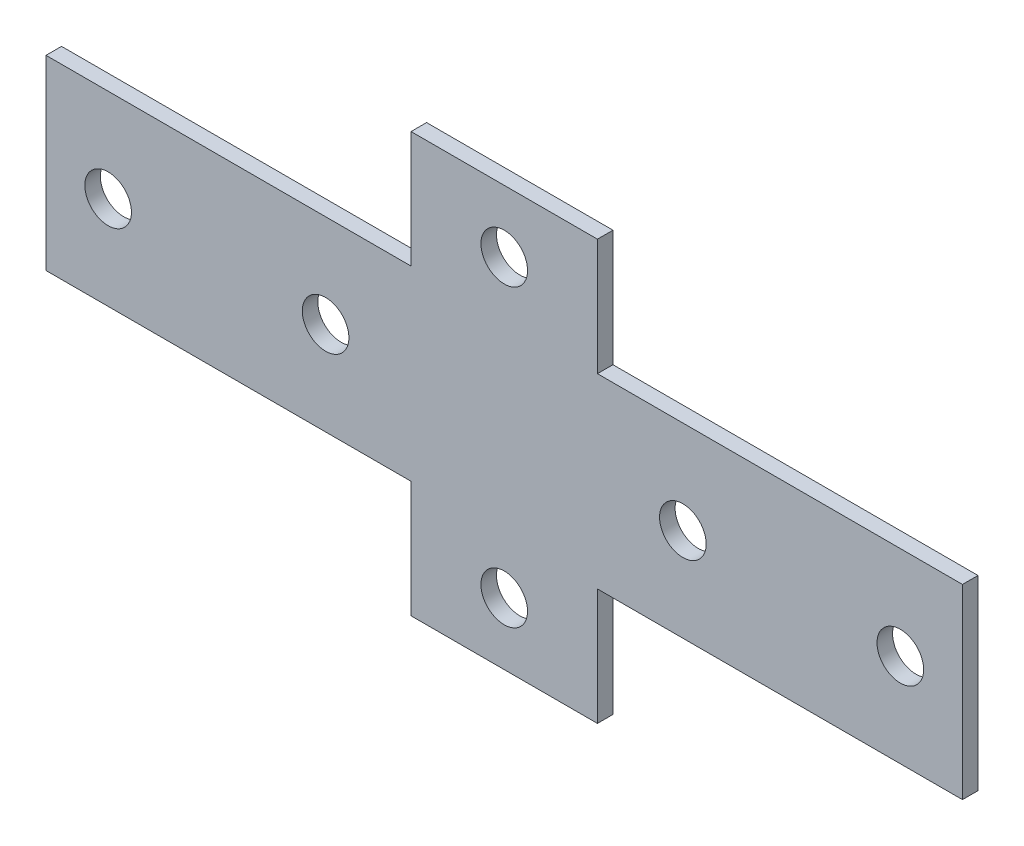
ISO-10303-21;
HEADER;
FILE_DESCRIPTION(('STEP AP214'),'2;1');
FILE_NAME('part.step','',(''),(''),'','','');
FILE_SCHEMA(('AUTOMOTIVE_DESIGN { 1 0 10303 214 1 1 1 1 }'));
ENDSEC;
DATA;
#1=APPLICATION_CONTEXT('core data for automotive mechanical design processes');
#2=APPLICATION_PROTOCOL_DEFINITION('international standard','automotive_design',2000,#1);
#3=PRODUCT_CONTEXT('',#1,'mechanical');
#4=PRODUCT('Part','Part','',(#3));
#5=PRODUCT_RELATED_PRODUCT_CATEGORY('part','',(#4));
#6=PRODUCT_DEFINITION_FORMATION('','',#4);
#7=PRODUCT_DEFINITION_CONTEXT('part definition',#1,'design');
#8=PRODUCT_DEFINITION('design','',#6,#7);
#9=PRODUCT_DEFINITION_SHAPE('','',#8);
#10=(LENGTH_UNIT() NAMED_UNIT(*) SI_UNIT(.MILLI.,.METRE.));
#11=(NAMED_UNIT(*) PLANE_ANGLE_UNIT() SI_UNIT($,.RADIAN.));
#12=(NAMED_UNIT(*) SI_UNIT($,.STERADIAN.) SOLID_ANGLE_UNIT());
#13=UNCERTAINTY_MEASURE_WITH_UNIT(LENGTH_MEASURE(1.E-05),#10,'distance_accuracy_value','');
#14=(GEOMETRIC_REPRESENTATION_CONTEXT(3) GLOBAL_UNCERTAINTY_ASSIGNED_CONTEXT((#13)) GLOBAL_UNIT_ASSIGNED_CONTEXT((#10,
#11,#12)) REPRESENTATION_CONTEXT('',''));
#15=CARTESIAN_POINT('',(0.,0.,0.));
#16=DIRECTION('',(0.,0.,1.));
#17=DIRECTION('',(1.,0.,0.));
#18=AXIS2_PLACEMENT_3D('',#15,#16,#17);
#19=CARTESIAN_POINT('',(0.,0.,3.));
#20=DIRECTION('',(0.,0.,1.));
#21=DIRECTION('',(1.,0.,0.));
#22=AXIS2_PLACEMENT_3D('',#19,#20,#21);
#23=PLANE('',#22);
#24=CARTESIAN_POINT('',(34.4999999999999,0.,3.));
#25=DIRECTION('',(0.,0.,1.));
#26=DIRECTION('',(-1.,0.,0.));
#27=AXIS2_PLACEMENT_3D('',#24,#25,#26);
#28=CIRCLE('',#27,4.5);
#29=CARTESIAN_POINT('',(29.9999999999999,0.,3.));
#30=VERTEX_POINT('',#29);
#31=EDGE_CURVE('E300',#30,#30,#28,.T.);
#32=ORIENTED_EDGE('',*,*,#31,.F.);
#33=EDGE_LOOP('',(#32));
#34=FACE_BOUND('',#33,.T.);
#35=CARTESIAN_POINT('',(-76.4999999999999,0.,3.));
#36=DIRECTION('',(0.,0.,1.));
#37=DIRECTION('',(1.,0.,0.));
#38=AXIS2_PLACEMENT_3D('',#35,#36,#37);
#39=CIRCLE('',#38,4.5);
#40=CARTESIAN_POINT('',(-71.9999999999999,0.,3.));
#41=VERTEX_POINT('',#40);
#42=EDGE_CURVE('E312',#41,#41,#39,.T.);
#43=ORIENTED_EDGE('',*,*,#42,.F.);
#44=EDGE_LOOP('',(#43));
#45=FACE_BOUND('',#44,.T.);
#46=CARTESIAN_POINT('',(0.,-28.5,3.));
#47=DIRECTION('',(0.,0.,1.));
#48=DIRECTION('',(1.,0.,0.));
#49=AXIS2_PLACEMENT_3D('',#46,#47,#48);
#50=CIRCLE('',#49,4.5);
#51=CARTESIAN_POINT('',(4.5,-28.5,3.));
#52=VERTEX_POINT('',#51);
#53=EDGE_CURVE('E159',#52,#52,#50,.T.);
#54=ORIENTED_EDGE('',*,*,#53,.F.);
#55=EDGE_LOOP('',(#54));
#56=FACE_BOUND('',#55,.T.);
#57=DIRECTION('',(0.,1.,0.));
#58=VECTOR('',#57,1.);
#59=CARTESIAN_POINT('',(88.5000000000001,18.,3.));
#60=LINE('',#59,#58);
#61=CARTESIAN_POINT('',(88.5000000000001,-18.,3.));
#62=VERTEX_POINT('',#61);
#63=CARTESIAN_POINT('',(88.5000000000001,18.,3.));
#64=VERTEX_POINT('',#63);
#65=EDGE_CURVE('E178',#62,#64,#60,.T.);
#66=ORIENTED_EDGE('',*,*,#65,.T.);
#67=DIRECTION('',(-1.,0.,0.));
#68=VECTOR('',#67,1.);
#69=CARTESIAN_POINT('',(18.,18.,3.));
#70=LINE('',#69,#68);
#71=CARTESIAN_POINT('',(18.,18.,3.));
#72=VERTEX_POINT('',#71);
#73=EDGE_CURVE('E106',#64,#72,#70,.T.);
#74=ORIENTED_EDGE('',*,*,#73,.T.);
#75=DIRECTION('',(0.,1.,0.));
#76=VECTOR('',#75,1.);
#77=CARTESIAN_POINT('',(18.,18.,3.));
#78=LINE('',#77,#76);
#79=CARTESIAN_POINT('',(18.,40.5,3.));
#80=VERTEX_POINT('',#79);
#81=EDGE_CURVE('E205',#72,#80,#78,.T.);
#82=ORIENTED_EDGE('',*,*,#81,.T.);
#83=DIRECTION('',(-1.,0.,0.));
#84=VECTOR('',#83,1.);
#85=CARTESIAN_POINT('',(-18.,40.5,3.));
#86=LINE('',#85,#84);
#87=CARTESIAN_POINT('',(-18.,40.5,3.));
#88=VERTEX_POINT('',#87);
#89=EDGE_CURVE('E224',#80,#88,#86,.T.);
#90=ORIENTED_EDGE('',*,*,#89,.T.);
#91=DIRECTION('',(0.,-1.,0.));
#92=VECTOR('',#91,1.);
#93=CARTESIAN_POINT('',(-18.,18.,3.));
#94=LINE('',#93,#92);
#95=CARTESIAN_POINT('',(-18.,18.,3.));
#96=VERTEX_POINT('',#95);
#97=EDGE_CURVE('E221',#88,#96,#94,.T.);
#98=ORIENTED_EDGE('',*,*,#97,.T.);
#99=DIRECTION('',(-1.,0.,0.));
#100=VECTOR('',#99,1.);
#101=CARTESIAN_POINT('',(-88.4999999999999,18.,3.));
#102=LINE('',#101,#100);
#103=CARTESIAN_POINT('',(-88.4999999999999,18.,3.));
#104=VERTEX_POINT('',#103);
#105=EDGE_CURVE('E223',#96,#104,#102,.T.);
#106=ORIENTED_EDGE('',*,*,#105,.T.);
#107=DIRECTION('',(0.,-1.,0.));
#108=VECTOR('',#107,1.);
#109=CARTESIAN_POINT('',(-88.4999999999999,18.,3.));
#110=LINE('',#109,#108);
#111=CARTESIAN_POINT('',(-88.4999999999999,-18.,3.));
#112=VERTEX_POINT('',#111);
#113=EDGE_CURVE('E226',#104,#112,#110,.T.);
#114=ORIENTED_EDGE('',*,*,#113,.T.);
#115=DIRECTION('',(1.,0.,0.));
#116=VECTOR('',#115,1.);
#117=CARTESIAN_POINT('',(-88.4999999999999,-18.,3.));
#118=LINE('',#117,#116);
#119=CARTESIAN_POINT('',(-18.,-18.,3.));
#120=VERTEX_POINT('',#119);
#121=EDGE_CURVE('E232',#112,#120,#118,.T.);
#122=ORIENTED_EDGE('',*,*,#121,.T.);
#123=DIRECTION('',(0.,-1.,0.));
#124=VECTOR('',#123,1.);
#125=CARTESIAN_POINT('',(-18.,-40.5,3.));
#126=LINE('',#125,#124);
#127=CARTESIAN_POINT('',(-18.,-40.5,3.));
#128=VERTEX_POINT('',#127);
#129=EDGE_CURVE('E137',#120,#128,#126,.T.);
#130=ORIENTED_EDGE('',*,*,#129,.T.);
#131=DIRECTION('',(1.,0.,0.));
#132=VECTOR('',#131,1.);
#133=CARTESIAN_POINT('',(-18.,-40.5,3.));
#134=LINE('',#133,#132);
#135=CARTESIAN_POINT('',(18.,-40.5,3.));
#136=VERTEX_POINT('',#135);
#137=EDGE_CURVE('E131',#128,#136,#134,.T.);
#138=ORIENTED_EDGE('',*,*,#137,.T.);
#139=DIRECTION('',(0.,1.,0.));
#140=VECTOR('',#139,1.);
#141=CARTESIAN_POINT('',(18.,-40.5,3.));
#142=LINE('',#141,#140);
#143=CARTESIAN_POINT('',(18.,-18.,3.));
#144=VERTEX_POINT('',#143);
#145=EDGE_CURVE('E135',#136,#144,#142,.T.);
#146=ORIENTED_EDGE('',*,*,#145,.T.);
#147=DIRECTION('',(1.,0.,0.));
#148=VECTOR('',#147,1.);
#149=CARTESIAN_POINT('',(18.,-18.,3.));
#150=LINE('',#149,#148);
#151=EDGE_CURVE('E51',#144,#62,#150,.T.);
#152=ORIENTED_EDGE('',*,*,#151,.T.);
#153=EDGE_LOOP('',(#66,#74,#82,#90,#98,#106,#114,#122,#130,#138,#146,#152));
#154=FACE_BOUND('',#153,.T.);
#155=CARTESIAN_POINT('',(0.,28.5,3.));
#156=DIRECTION('',(0.,0.,1.));
#157=DIRECTION('',(1.,0.,0.));
#158=AXIS2_PLACEMENT_3D('',#155,#156,#157);
#159=CIRCLE('',#158,4.5);
#160=CARTESIAN_POINT('',(4.5,28.5,3.));
#161=VERTEX_POINT('',#160);
#162=EDGE_CURVE('E318',#161,#161,#159,.T.);
#163=ORIENTED_EDGE('',*,*,#162,.F.);
#164=EDGE_LOOP('',(#163));
#165=FACE_BOUND('',#164,.T.);
#166=CARTESIAN_POINT('',(-34.4999999999999,0.,3.));
#167=DIRECTION('',(0.,0.,1.));
#168=DIRECTION('',(1.,0.,0.));
#169=AXIS2_PLACEMENT_3D('',#166,#167,#168);
#170=CIRCLE('',#169,4.5);
#171=CARTESIAN_POINT('',(-29.9999999999999,0.,3.));
#172=VERTEX_POINT('',#171);
#173=EDGE_CURVE('E306',#172,#172,#170,.T.);
#174=ORIENTED_EDGE('',*,*,#173,.F.);
#175=EDGE_LOOP('',(#174));
#176=FACE_BOUND('',#175,.T.);
#177=CARTESIAN_POINT('',(76.4999999999999,0.,3.));
#178=DIRECTION('',(0.,0.,1.));
#179=DIRECTION('',(-1.,0.,0.));
#180=AXIS2_PLACEMENT_3D('',#177,#178,#179);
#181=CIRCLE('',#180,4.5);
#182=CARTESIAN_POINT('',(71.9999999999999,0.,3.));
#183=VERTEX_POINT('',#182);
#184=EDGE_CURVE('E291',#183,#183,#181,.T.);
#185=ORIENTED_EDGE('',*,*,#184,.F.);
#186=EDGE_LOOP('',(#185));
#187=FACE_BOUND('',#186,.T.);
#188=ADVANCED_FACE('F34',(#34,#45,#56,#154,#165,#176,#187),#23,.T.);
#189=CARTESIAN_POINT('',(0.,0.,0.));
#190=DIRECTION('',(0.,0.,1.));
#191=DIRECTION('',(1.,0.,0.));
#192=AXIS2_PLACEMENT_3D('',#189,#190,#191);
#193=PLANE('',#192);
#194=DIRECTION('',(0.,1.,0.));
#195=VECTOR('',#194,1.);
#196=CARTESIAN_POINT('',(88.5000000000001,18.,0.));
#197=LINE('',#196,#195);
#198=CARTESIAN_POINT('',(88.5000000000001,-18.,0.));
#199=VERTEX_POINT('',#198);
#200=CARTESIAN_POINT('',(88.5000000000001,18.,0.));
#201=VERTEX_POINT('',#200);
#202=EDGE_CURVE('E155',#199,#201,#197,.T.);
#203=ORIENTED_EDGE('',*,*,#202,.F.);
#204=DIRECTION('',(1.,0.,0.));
#205=VECTOR('',#204,1.);
#206=CARTESIAN_POINT('',(18.,-18.,0.));
#207=LINE('',#206,#205);
#208=CARTESIAN_POINT('',(18.,-18.,0.));
#209=VERTEX_POINT('',#208);
#210=EDGE_CURVE('E98',#209,#199,#207,.T.);
#211=ORIENTED_EDGE('',*,*,#210,.F.);
#212=DIRECTION('',(0.,1.,0.));
#213=VECTOR('',#212,1.);
#214=CARTESIAN_POINT('',(18.,-40.5,0.));
#215=LINE('',#214,#213);
#216=CARTESIAN_POINT('',(18.,-40.5,0.));
#217=VERTEX_POINT('',#216);
#218=EDGE_CURVE('E92',#217,#209,#215,.T.);
#219=ORIENTED_EDGE('',*,*,#218,.F.);
#220=DIRECTION('',(1.,0.,0.));
#221=VECTOR('',#220,1.);
#222=CARTESIAN_POINT('',(-18.,-40.5,0.));
#223=LINE('',#222,#221);
#224=CARTESIAN_POINT('',(-18.,-40.5,0.));
#225=VERTEX_POINT('',#224);
#226=EDGE_CURVE('E145',#225,#217,#223,.T.);
#227=ORIENTED_EDGE('',*,*,#226,.F.);
#228=DIRECTION('',(0.,-1.,0.));
#229=VECTOR('',#228,1.);
#230=CARTESIAN_POINT('',(-18.,-40.5,0.));
#231=LINE('',#230,#229);
#232=CARTESIAN_POINT('',(-18.,-18.,0.));
#233=VERTEX_POINT('',#232);
#234=EDGE_CURVE('E173',#233,#225,#231,.T.);
#235=ORIENTED_EDGE('',*,*,#234,.F.);
#236=DIRECTION('',(1.,0.,0.));
#237=VECTOR('',#236,1.);
#238=CARTESIAN_POINT('',(-88.4999999999999,-18.,0.));
#239=LINE('',#238,#237);
#240=CARTESIAN_POINT('',(-88.4999999999999,-18.,0.));
#241=VERTEX_POINT('',#240);
#242=EDGE_CURVE('E171',#241,#233,#239,.T.);
#243=ORIENTED_EDGE('',*,*,#242,.F.);
#244=DIRECTION('',(0.,-1.,0.));
#245=VECTOR('',#244,1.);
#246=CARTESIAN_POINT('',(-88.4999999999999,18.,0.));
#247=LINE('',#246,#245);
#248=CARTESIAN_POINT('',(-88.4999999999999,18.,0.));
#249=VERTEX_POINT('',#248);
#250=EDGE_CURVE('E169',#249,#241,#247,.T.);
#251=ORIENTED_EDGE('',*,*,#250,.F.);
#252=DIRECTION('',(-1.,0.,0.));
#253=VECTOR('',#252,1.);
#254=CARTESIAN_POINT('',(-88.4999999999999,18.,0.));
#255=LINE('',#254,#253);
#256=CARTESIAN_POINT('',(-18.,18.,0.));
#257=VERTEX_POINT('',#256);
#258=EDGE_CURVE('E167',#257,#249,#255,.T.);
#259=ORIENTED_EDGE('',*,*,#258,.F.);
#260=DIRECTION('',(0.,-1.,0.));
#261=VECTOR('',#260,1.);
#262=CARTESIAN_POINT('',(-18.,18.,0.));
#263=LINE('',#262,#261);
#264=CARTESIAN_POINT('',(-18.,40.5,0.));
#265=VERTEX_POINT('',#264);
#266=EDGE_CURVE('E165',#265,#257,#263,.T.);
#267=ORIENTED_EDGE('',*,*,#266,.F.);
#268=DIRECTION('',(-1.,0.,0.));
#269=VECTOR('',#268,1.);
#270=CARTESIAN_POINT('',(-18.,40.5,0.));
#271=LINE('',#270,#269);
#272=CARTESIAN_POINT('',(18.,40.5,0.));
#273=VERTEX_POINT('',#272);
#274=EDGE_CURVE('E163',#273,#265,#271,.T.);
#275=ORIENTED_EDGE('',*,*,#274,.F.);
#276=DIRECTION('',(0.,1.,0.));
#277=VECTOR('',#276,1.);
#278=CARTESIAN_POINT('',(18.,18.,0.));
#279=LINE('',#278,#277);
#280=CARTESIAN_POINT('',(18.,18.,0.));
#281=VERTEX_POINT('',#280);
#282=EDGE_CURVE('E161',#281,#273,#279,.T.);
#283=ORIENTED_EDGE('',*,*,#282,.F.);
#284=DIRECTION('',(-1.,0.,0.));
#285=VECTOR('',#284,1.);
#286=CARTESIAN_POINT('',(18.,18.,0.));
#287=LINE('',#286,#285);
#288=EDGE_CURVE('E158',#201,#281,#287,.T.);
#289=ORIENTED_EDGE('',*,*,#288,.F.);
#290=EDGE_LOOP('',(#203,#211,#219,#227,#235,#243,#251,#259,#267,#275,#283,#289));
#291=FACE_BOUND('',#290,.T.);
#292=CARTESIAN_POINT('',(0.,-28.5,0.));
#293=DIRECTION('',(0.,0.,1.));
#294=DIRECTION('',(1.,0.,0.));
#295=AXIS2_PLACEMENT_3D('',#292,#293,#294);
#296=CIRCLE('',#295,4.5);
#297=CARTESIAN_POINT('',(4.5,-28.5,0.));
#298=VERTEX_POINT('',#297);
#299=EDGE_CURVE('E321',#298,#298,#296,.T.);
#300=ORIENTED_EDGE('',*,*,#299,.T.);
#301=EDGE_LOOP('',(#300));
#302=FACE_BOUND('',#301,.T.);
#303=CARTESIAN_POINT('',(0.,28.5,0.));
#304=DIRECTION('',(0.,0.,1.));
#305=DIRECTION('',(1.,0.,0.));
#306=AXIS2_PLACEMENT_3D('',#303,#304,#305);
#307=CIRCLE('',#306,4.5);
#308=CARTESIAN_POINT('',(4.5,28.5,0.));
#309=VERTEX_POINT('',#308);
#310=EDGE_CURVE('E315',#309,#309,#307,.T.);
#311=ORIENTED_EDGE('',*,*,#310,.T.);
#312=EDGE_LOOP('',(#311));
#313=FACE_BOUND('',#312,.T.);
#314=CARTESIAN_POINT('',(-76.4999999999999,0.,0.));
#315=DIRECTION('',(0.,0.,1.));
#316=DIRECTION('',(1.,0.,0.));
#317=AXIS2_PLACEMENT_3D('',#314,#315,#316);
#318=CIRCLE('',#317,4.5);
#319=CARTESIAN_POINT('',(-71.9999999999999,0.,0.));
#320=VERTEX_POINT('',#319);
#321=EDGE_CURVE('E309',#320,#320,#318,.T.);
#322=ORIENTED_EDGE('',*,*,#321,.T.);
#323=EDGE_LOOP('',(#322));
#324=FACE_BOUND('',#323,.T.);
#325=CARTESIAN_POINT('',(-34.4999999999999,0.,0.));
#326=DIRECTION('',(0.,0.,1.));
#327=DIRECTION('',(1.,0.,0.));
#328=AXIS2_PLACEMENT_3D('',#325,#326,#327);
#329=CIRCLE('',#328,4.5);
#330=CARTESIAN_POINT('',(-29.9999999999999,0.,0.));
#331=VERTEX_POINT('',#330);
#332=EDGE_CURVE('E303',#331,#331,#329,.T.);
#333=ORIENTED_EDGE('',*,*,#332,.T.);
#334=EDGE_LOOP('',(#333));
#335=FACE_BOUND('',#334,.T.);
#336=CARTESIAN_POINT('',(34.4999999999999,0.,0.));
#337=DIRECTION('',(0.,0.,1.));
#338=DIRECTION('',(-1.,0.,0.));
#339=AXIS2_PLACEMENT_3D('',#336,#337,#338);
#340=CIRCLE('',#339,4.5);
#341=CARTESIAN_POINT('',(29.9999999999999,0.,0.));
#342=VERTEX_POINT('',#341);
#343=EDGE_CURVE('E297',#342,#342,#340,.T.);
#344=ORIENTED_EDGE('',*,*,#343,.T.);
#345=EDGE_LOOP('',(#344));
#346=FACE_BOUND('',#345,.T.);
#347=CARTESIAN_POINT('',(76.4999999999999,0.,0.));
#348=DIRECTION('',(0.,0.,1.));
#349=DIRECTION('',(-1.,0.,0.));
#350=AXIS2_PLACEMENT_3D('',#347,#348,#349);
#351=CIRCLE('',#350,4.5);
#352=CARTESIAN_POINT('',(71.9999999999999,0.,0.));
#353=VERTEX_POINT('',#352);
#354=EDGE_CURVE('E294',#353,#353,#351,.T.);
#355=ORIENTED_EDGE('',*,*,#354,.T.);
#356=EDGE_LOOP('',(#355));
#357=FACE_BOUND('',#356,.T.);
#358=ADVANCED_FACE('F209',(#291,#302,#313,#324,#335,#346,#357),#193,.F.);
#359=CARTESIAN_POINT('',(88.5000000000001,18.,3.));
#360=DIRECTION('',(-1.,0.,0.));
#361=DIRECTION('',(0.,0.,1.));
#362=AXIS2_PLACEMENT_3D('',#359,#360,#361);
#363=PLANE('',#362);
#364=ORIENTED_EDGE('',*,*,#202,.T.);
#365=DIRECTION('',(0.,0.,-1.));
#366=VECTOR('',#365,1.);
#367=CARTESIAN_POINT('',(88.5000000000001,18.,3.));
#368=LINE('',#367,#366);
#369=EDGE_CURVE('E11',#64,#201,#368,.T.);
#370=ORIENTED_EDGE('',*,*,#369,.F.);
#371=ORIENTED_EDGE('',*,*,#65,.F.);
#372=DIRECTION('',(0.,0.,-1.));
#373=VECTOR('',#372,1.);
#374=CARTESIAN_POINT('',(88.5000000000001,-18.,3.));
#375=LINE('',#374,#373);
#376=EDGE_CURVE('E151',#62,#199,#375,.T.);
#377=ORIENTED_EDGE('',*,*,#376,.T.);
#378=EDGE_LOOP('',(#364,#370,#371,#377));
#379=FACE_BOUND('',#378,.T.);
#380=ADVANCED_FACE('F36',(#379),#363,.F.);
#381=CARTESIAN_POINT('',(18.,18.,3.));
#382=DIRECTION('',(0.,-1.,0.));
#383=DIRECTION('',(1.,0.,0.));
#384=AXIS2_PLACEMENT_3D('',#381,#382,#383);
#385=PLANE('',#384);
#386=ORIENTED_EDGE('',*,*,#288,.T.);
#387=DIRECTION('',(0.,0.,-1.));
#388=VECTOR('',#387,1.);
#389=CARTESIAN_POINT('',(18.,18.,3.));
#390=LINE('',#389,#388);
#391=EDGE_CURVE('E43',#72,#281,#390,.T.);
#392=ORIENTED_EDGE('',*,*,#391,.F.);
#393=ORIENTED_EDGE('',*,*,#73,.F.);
#394=ORIENTED_EDGE('',*,*,#369,.T.);
#395=EDGE_LOOP('',(#386,#392,#393,#394));
#396=FACE_BOUND('',#395,.T.);
#397=ADVANCED_FACE('F449',(#396),#385,.F.);
#398=CARTESIAN_POINT('',(18.,18.,3.));
#399=DIRECTION('',(-1.,0.,0.));
#400=DIRECTION('',(0.,-1.,0.));
#401=AXIS2_PLACEMENT_3D('',#398,#399,#400);
#402=PLANE('',#401);
#403=ORIENTED_EDGE('',*,*,#282,.T.);
#404=DIRECTION('',(0.,0.,-1.));
#405=VECTOR('',#404,1.);
#406=CARTESIAN_POINT('',(18.,40.5,3.));
#407=LINE('',#406,#405);
#408=EDGE_CURVE('E197',#80,#273,#407,.T.);
#409=ORIENTED_EDGE('',*,*,#408,.F.);
#410=ORIENTED_EDGE('',*,*,#81,.F.);
#411=ORIENTED_EDGE('',*,*,#391,.T.);
#412=EDGE_LOOP('',(#403,#409,#410,#411));
#413=FACE_BOUND('',#412,.T.);
#414=ADVANCED_FACE('F203',(#413),#402,.F.);
#415=CARTESIAN_POINT('',(-18.,40.5,3.));
#416=DIRECTION('',(0.,-1.,0.));
#417=DIRECTION('',(0.,0.,-1.));
#418=AXIS2_PLACEMENT_3D('',#415,#416,#417);
#419=PLANE('',#418);
#420=ORIENTED_EDGE('',*,*,#274,.T.);
#421=DIRECTION('',(0.,0.,-1.));
#422=VECTOR('',#421,1.);
#423=CARTESIAN_POINT('',(-18.,40.5,3.));
#424=LINE('',#423,#422);
#425=EDGE_CURVE('E194',#88,#265,#424,.T.);
#426=ORIENTED_EDGE('',*,*,#425,.F.);
#427=ORIENTED_EDGE('',*,*,#89,.F.);
#428=ORIENTED_EDGE('',*,*,#408,.T.);
#429=EDGE_LOOP('',(#420,#426,#427,#428));
#430=FACE_BOUND('',#429,.T.);
#431=ADVANCED_FACE('F215',(#430),#419,.F.);
#432=CARTESIAN_POINT('',(-18.,18.,3.));
#433=DIRECTION('',(1.,0.,0.));
#434=DIRECTION('',(0.,1.,0.));
#435=AXIS2_PLACEMENT_3D('',#432,#433,#434);
#436=PLANE('',#435);
#437=ORIENTED_EDGE('',*,*,#266,.T.);
#438=DIRECTION('',(0.,0.,-1.));
#439=VECTOR('',#438,1.);
#440=CARTESIAN_POINT('',(-18.,18.,3.));
#441=LINE('',#440,#439);
#442=EDGE_CURVE('E191',#96,#257,#441,.T.);
#443=ORIENTED_EDGE('',*,*,#442,.F.);
#444=ORIENTED_EDGE('',*,*,#97,.F.);
#445=ORIENTED_EDGE('',*,*,#425,.T.);
#446=EDGE_LOOP('',(#437,#443,#444,#445));
#447=FACE_BOUND('',#446,.T.);
#448=ADVANCED_FACE('F219',(#447),#436,.F.);
#449=CARTESIAN_POINT('',(-88.4999999999999,18.,3.));
#450=DIRECTION('',(0.,-1.,0.));
#451=DIRECTION('',(1.,0.,0.));
#452=AXIS2_PLACEMENT_3D('',#449,#450,#451);
#453=PLANE('',#452);
#454=ORIENTED_EDGE('',*,*,#258,.T.);
#455=DIRECTION('',(0.,0.,-1.));
#456=VECTOR('',#455,1.);
#457=CARTESIAN_POINT('',(-88.4999999999999,18.,3.));
#458=LINE('',#457,#456);
#459=EDGE_CURVE('E188',#104,#249,#458,.T.);
#460=ORIENTED_EDGE('',*,*,#459,.F.);
#461=ORIENTED_EDGE('',*,*,#105,.F.);
#462=ORIENTED_EDGE('',*,*,#442,.T.);
#463=EDGE_LOOP('',(#454,#460,#461,#462));
#464=FACE_BOUND('',#463,.T.);
#465=ADVANCED_FACE('F414',(#464),#453,.F.);
#466=CARTESIAN_POINT('',(-88.4999999999999,18.,3.));
#467=DIRECTION('',(1.,0.,0.));
#468=DIRECTION('',(0.,0.,-1.));
#469=AXIS2_PLACEMENT_3D('',#466,#467,#468);
#470=PLANE('',#469);
#471=ORIENTED_EDGE('',*,*,#250,.T.);
#472=DIRECTION('',(0.,0.,-1.));
#473=VECTOR('',#472,1.);
#474=CARTESIAN_POINT('',(-88.4999999999999,-18.,3.));
#475=LINE('',#474,#473);
#476=EDGE_CURVE('E185',#112,#241,#475,.T.);
#477=ORIENTED_EDGE('',*,*,#476,.F.);
#478=ORIENTED_EDGE('',*,*,#113,.F.);
#479=ORIENTED_EDGE('',*,*,#459,.T.);
#480=EDGE_LOOP('',(#471,#477,#478,#479));
#481=FACE_BOUND('',#480,.T.);
#482=ADVANCED_FACE('F405',(#481),#470,.F.);
#483=CARTESIAN_POINT('',(-88.4999999999999,-18.,3.));
#484=DIRECTION('',(0.,1.,0.));
#485=DIRECTION('',(-1.,0.,0.));
#486=AXIS2_PLACEMENT_3D('',#483,#484,#485);
#487=PLANE('',#486);
#488=ORIENTED_EDGE('',*,*,#242,.T.);
#489=DIRECTION('',(0.,0.,-1.));
#490=VECTOR('',#489,1.);
#491=CARTESIAN_POINT('',(-18.,-18.,3.));
#492=LINE('',#491,#490);
#493=EDGE_CURVE('E182',#120,#233,#492,.T.);
#494=ORIENTED_EDGE('',*,*,#493,.F.);
#495=ORIENTED_EDGE('',*,*,#121,.F.);
#496=ORIENTED_EDGE('',*,*,#476,.T.);
#497=EDGE_LOOP('',(#488,#494,#495,#496));
#498=FACE_BOUND('',#497,.T.);
#499=ADVANCED_FACE('F238',(#498),#487,.F.);
#500=CARTESIAN_POINT('',(-18.,-40.5,3.));
#501=DIRECTION('',(1.,0.,0.));
#502=DIRECTION('',(0.,1.,0.));
#503=AXIS2_PLACEMENT_3D('',#500,#501,#502);
#504=PLANE('',#503);
#505=ORIENTED_EDGE('',*,*,#234,.T.);
#506=DIRECTION('',(0.,0.,-1.));
#507=VECTOR('',#506,1.);
#508=CARTESIAN_POINT('',(-18.,-40.5,3.));
#509=LINE('',#508,#507);
#510=EDGE_CURVE('E146',#128,#225,#509,.T.);
#511=ORIENTED_EDGE('',*,*,#510,.F.);
#512=ORIENTED_EDGE('',*,*,#129,.F.);
#513=ORIENTED_EDGE('',*,*,#493,.T.);
#514=EDGE_LOOP('',(#505,#511,#512,#513));
#515=FACE_BOUND('',#514,.T.);
#516=ADVANCED_FACE('F242',(#515),#504,.F.);
#517=CARTESIAN_POINT('',(-18.,-40.5,3.));
#518=DIRECTION('',(0.,1.,0.));
#519=DIRECTION('',(0.,0.,1.));
#520=AXIS2_PLACEMENT_3D('',#517,#518,#519);
#521=PLANE('',#520);
#522=ORIENTED_EDGE('',*,*,#226,.T.);
#523=DIRECTION('',(0.,0.,-1.));
#524=VECTOR('',#523,1.);
#525=CARTESIAN_POINT('',(18.,-40.5,3.));
#526=LINE('',#525,#524);
#527=EDGE_CURVE('E142',#136,#217,#526,.T.);
#528=ORIENTED_EDGE('',*,*,#527,.F.);
#529=ORIENTED_EDGE('',*,*,#137,.F.);
#530=ORIENTED_EDGE('',*,*,#510,.T.);
#531=EDGE_LOOP('',(#522,#528,#529,#530));
#532=FACE_BOUND('',#531,.T.);
#533=ADVANCED_FACE('F143',(#532),#521,.F.);
#534=CARTESIAN_POINT('',(18.,-40.5,3.));
#535=DIRECTION('',(-1.,0.,0.));
#536=DIRECTION('',(0.,-1.,0.));
#537=AXIS2_PLACEMENT_3D('',#534,#535,#536);
#538=PLANE('',#537);
#539=ORIENTED_EDGE('',*,*,#218,.T.);
#540=DIRECTION('',(0.,0.,-1.));
#541=VECTOR('',#540,1.);
#542=CARTESIAN_POINT('',(18.,-18.,3.));
#543=LINE('',#542,#541);
#544=EDGE_CURVE('E147',#144,#209,#543,.T.);
#545=ORIENTED_EDGE('',*,*,#544,.F.);
#546=ORIENTED_EDGE('',*,*,#145,.F.);
#547=ORIENTED_EDGE('',*,*,#527,.T.);
#548=EDGE_LOOP('',(#539,#545,#546,#547));
#549=FACE_BOUND('',#548,.T.);
#550=ADVANCED_FACE('F149',(#549),#538,.F.);
#551=CARTESIAN_POINT('',(18.,-18.,3.));
#552=DIRECTION('',(0.,1.,0.));
#553=DIRECTION('',(-1.,0.,0.));
#554=AXIS2_PLACEMENT_3D('',#551,#552,#553);
#555=PLANE('',#554);
#556=ORIENTED_EDGE('',*,*,#210,.T.);
#557=ORIENTED_EDGE('',*,*,#376,.F.);
#558=ORIENTED_EDGE('',*,*,#151,.F.);
#559=ORIENTED_EDGE('',*,*,#544,.T.);
#560=EDGE_LOOP('',(#556,#557,#558,#559));
#561=FACE_BOUND('',#560,.T.);
#562=ADVANCED_FACE('F246',(#561),#555,.F.);
#563=CARTESIAN_POINT('',(0.,-28.5,3.));
#564=DIRECTION('',(0.,0.,-1.));
#565=DIRECTION('',(-1.,0.,0.));
#566=AXIS2_PLACEMENT_3D('',#563,#564,#565);
#567=CYLINDRICAL_SURFACE('',#566,4.5);
#568=ORIENTED_EDGE('',*,*,#53,.T.);
#569=EDGE_LOOP('',(#568));
#570=FACE_BOUND('',#569,.T.);
#571=ORIENTED_EDGE('',*,*,#299,.F.);
#572=EDGE_LOOP('',(#571));
#573=FACE_BOUND('',#572,.T.);
#574=ADVANCED_FACE('F248',(#570,#573),#567,.F.);
#575=CARTESIAN_POINT('',(0.,28.5,3.));
#576=DIRECTION('',(0.,0.,-1.));
#577=DIRECTION('',(-1.,0.,0.));
#578=AXIS2_PLACEMENT_3D('',#575,#576,#577);
#579=CYLINDRICAL_SURFACE('',#578,4.5);
#580=ORIENTED_EDGE('',*,*,#162,.T.);
#581=EDGE_LOOP('',(#580));
#582=FACE_BOUND('',#581,.T.);
#583=ORIENTED_EDGE('',*,*,#310,.F.);
#584=EDGE_LOOP('',(#583));
#585=FACE_BOUND('',#584,.T.);
#586=ADVANCED_FACE('F254',(#582,#585),#579,.F.);
#587=CARTESIAN_POINT('',(-76.4999999999999,0.,3.));
#588=DIRECTION('',(0.,0.,-1.));
#589=DIRECTION('',(-1.,0.,0.));
#590=AXIS2_PLACEMENT_3D('',#587,#588,#589);
#591=CYLINDRICAL_SURFACE('',#590,4.5);
#592=ORIENTED_EDGE('',*,*,#42,.T.);
#593=EDGE_LOOP('',(#592));
#594=FACE_BOUND('',#593,.T.);
#595=ORIENTED_EDGE('',*,*,#321,.F.);
#596=EDGE_LOOP('',(#595));
#597=FACE_BOUND('',#596,.T.);
#598=ADVANCED_FACE('F270',(#594,#597),#591,.F.);
#599=CARTESIAN_POINT('',(-34.4999999999999,0.,3.));
#600=DIRECTION('',(0.,0.,-1.));
#601=DIRECTION('',(-1.,0.,0.));
#602=AXIS2_PLACEMENT_3D('',#599,#600,#601);
#603=CYLINDRICAL_SURFACE('',#602,4.5);
#604=ORIENTED_EDGE('',*,*,#173,.T.);
#605=EDGE_LOOP('',(#604));
#606=FACE_BOUND('',#605,.T.);
#607=ORIENTED_EDGE('',*,*,#332,.F.);
#608=EDGE_LOOP('',(#607));
#609=FACE_BOUND('',#608,.T.);
#610=ADVANCED_FACE('F274',(#606,#609),#603,.F.);
#611=CARTESIAN_POINT('',(34.4999999999999,0.,3.));
#612=DIRECTION('',(0.,0.,-1.));
#613=DIRECTION('',(-1.,0.,0.));
#614=AXIS2_PLACEMENT_3D('',#611,#612,#613);
#615=CYLINDRICAL_SURFACE('',#614,4.5);
#616=ORIENTED_EDGE('',*,*,#31,.T.);
#617=EDGE_LOOP('',(#616));
#618=FACE_BOUND('',#617,.T.);
#619=ORIENTED_EDGE('',*,*,#343,.F.);
#620=EDGE_LOOP('',(#619));
#621=FACE_BOUND('',#620,.T.);
#622=ADVANCED_FACE('F278',(#618,#621),#615,.F.);
#623=CARTESIAN_POINT('',(76.4999999999999,0.,3.));
#624=DIRECTION('',(0.,0.,-1.));
#625=DIRECTION('',(-1.,0.,0.));
#626=AXIS2_PLACEMENT_3D('',#623,#624,#625);
#627=CYLINDRICAL_SURFACE('',#626,4.5);
#628=ORIENTED_EDGE('',*,*,#184,.T.);
#629=EDGE_LOOP('',(#628));
#630=FACE_BOUND('',#629,.T.);
#631=ORIENTED_EDGE('',*,*,#354,.F.);
#632=EDGE_LOOP('',(#631));
#633=FACE_BOUND('',#632,.T.);
#634=ADVANCED_FACE('F282',(#630,#633),#627,.F.);
#635=CLOSED_SHELL('',(#188,#358,#380,#397,#414,#431,#448,#465,#482,#499,#516,#533,#550,#562,
#574,#586,#598,#610,#622,#634));
#636=MANIFOLD_SOLID_BREP('B2',#635);
#637=ADVANCED_BREP_SHAPE_REPRESENTATION('',(#18,#636),#14);
#638=SHAPE_DEFINITION_REPRESENTATION(#9,#637);
ENDSEC;
END-ISO-10303-21;
